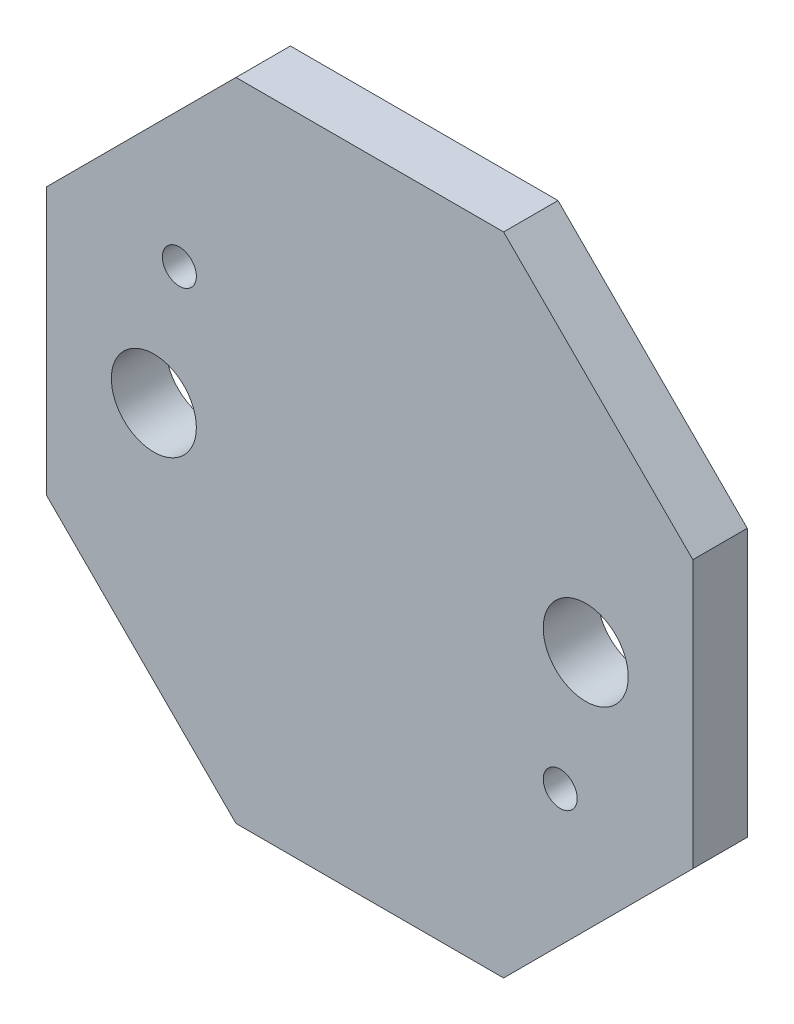
ISO-10303-21;
HEADER;
FILE_DESCRIPTION(('STEP AP214'),'2;1');
FILE_NAME('part.step','',(''),(''),'','','');
FILE_SCHEMA(('AUTOMOTIVE_DESIGN { 1 0 10303 214 1 1 1 1 }'));
ENDSEC;
DATA;
#1=APPLICATION_CONTEXT('core data for automotive mechanical design processes');
#2=APPLICATION_PROTOCOL_DEFINITION('international standard','automotive_design',2000,#1);
#3=PRODUCT_CONTEXT('',#1,'mechanical');
#4=PRODUCT('Part','Part','',(#3));
#5=PRODUCT_RELATED_PRODUCT_CATEGORY('part','',(#4));
#6=PRODUCT_DEFINITION_FORMATION('','',#4);
#7=PRODUCT_DEFINITION_CONTEXT('part definition',#1,'design');
#8=PRODUCT_DEFINITION('design','',#6,#7);
#9=PRODUCT_DEFINITION_SHAPE('','',#8);
#10=(LENGTH_UNIT() NAMED_UNIT(*) SI_UNIT(.MILLI.,.METRE.));
#11=(NAMED_UNIT(*) PLANE_ANGLE_UNIT() SI_UNIT($,.RADIAN.));
#12=(NAMED_UNIT(*) SI_UNIT($,.STERADIAN.) SOLID_ANGLE_UNIT());
#13=UNCERTAINTY_MEASURE_WITH_UNIT(LENGTH_MEASURE(1.E-05),#10,'distance_accuracy_value','');
#14=(GEOMETRIC_REPRESENTATION_CONTEXT(3) GLOBAL_UNCERTAINTY_ASSIGNED_CONTEXT((#13)) GLOBAL_UNIT_ASSIGNED_CONTEXT((#10,
#11,#12)) REPRESENTATION_CONTEXT('',''));
#15=CARTESIAN_POINT('',(0.,0.,0.));
#16=DIRECTION('',(0.,0.,1.));
#17=DIRECTION('',(1.,0.,0.));
#18=AXIS2_PLACEMENT_3D('',#15,#16,#17);
#19=CARTESIAN_POINT('',(0.,0.,1.6));
#20=DIRECTION('',(0.,0.,1.));
#21=DIRECTION('',(1.,0.,0.));
#22=AXIS2_PLACEMENT_3D('',#19,#20,#21);
#23=PLANE('',#22);
#24=CARTESIAN_POINT('',(-6.35,0.,1.6));
#25=DIRECTION('',(0.,0.,1.));
#26=DIRECTION('',(1.,0.,0.));
#27=AXIS2_PLACEMENT_3D('',#24,#25,#26);
#28=CIRCLE('',#27,1.25);
#29=CARTESIAN_POINT('',(-5.1,0.,1.6));
#30=VERTEX_POINT('',#29);
#31=EDGE_CURVE('E188',#30,#30,#28,.T.);
#32=ORIENTED_EDGE('',*,*,#31,.F.);
#33=EDGE_LOOP('',(#32));
#34=FACE_BOUND('',#33,.T.);
#35=CARTESIAN_POINT('',(6.35,0.,1.6));
#36=DIRECTION('',(0.,0.,1.));
#37=DIRECTION('',(1.,0.,0.));
#38=AXIS2_PLACEMENT_3D('',#35,#36,#37);
#39=CIRCLE('',#38,1.25);
#40=CARTESIAN_POINT('',(7.6,0.,1.6));
#41=VERTEX_POINT('',#40);
#42=EDGE_CURVE('E134',#41,#41,#39,.T.);
#43=ORIENTED_EDGE('',*,*,#42,.F.);
#44=EDGE_LOOP('',(#43));
#45=FACE_BOUND('',#44,.T.);
#46=DIRECTION('',(0.,1.,0.));
#47=VECTOR('',#46,1.);
#48=CARTESIAN_POINT('',(9.5,-3.9350288425444,1.6));
#49=LINE('',#48,#47);
#50=CARTESIAN_POINT('',(9.5,-3.9350288425444,1.6));
#51=VERTEX_POINT('',#50);
#52=CARTESIAN_POINT('',(9.5,3.9350288425444,1.6));
#53=VERTEX_POINT('',#52);
#54=EDGE_CURVE('E145',#51,#53,#49,.T.);
#55=ORIENTED_EDGE('',*,*,#54,.T.);
#56=DIRECTION('',(-0.707106781186548,0.707106781186547,0.));
#57=VECTOR('',#56,1.);
#58=CARTESIAN_POINT('',(9.5,3.9350288425444,1.6));
#59=LINE('',#58,#57);
#60=CARTESIAN_POINT('',(3.9350288425444,9.50000000000001,1.6));
#61=VERTEX_POINT('',#60);
#62=EDGE_CURVE('E93',#53,#61,#59,.T.);
#63=ORIENTED_EDGE('',*,*,#62,.T.);
#64=DIRECTION('',(-1.,0.,0.));
#65=VECTOR('',#64,1.);
#66=CARTESIAN_POINT('',(3.9350288425444,9.50000000000001,1.6));
#67=LINE('',#66,#65);
#68=CARTESIAN_POINT('',(-3.93502884254441,9.5,1.6));
#69=VERTEX_POINT('',#68);
#70=EDGE_CURVE('E160',#61,#69,#67,.T.);
#71=ORIENTED_EDGE('',*,*,#70,.T.);
#72=DIRECTION('',(-0.707106781186547,-0.707106781186548,0.));
#73=VECTOR('',#72,1.);
#74=CARTESIAN_POINT('',(-3.93502884254441,9.5,1.6));
#75=LINE('',#74,#73);
#76=CARTESIAN_POINT('',(-9.5,3.93502884254441,1.6));
#77=VERTEX_POINT('',#76);
#78=EDGE_CURVE('E173',#69,#77,#75,.T.);
#79=ORIENTED_EDGE('',*,*,#78,.T.);
#80=DIRECTION('',(0.,-1.,0.));
#81=VECTOR('',#80,1.);
#82=CARTESIAN_POINT('',(-9.5,3.93502884254441,1.6));
#83=LINE('',#82,#81);
#84=CARTESIAN_POINT('',(-9.5,-3.93502884254441,1.6));
#85=VERTEX_POINT('',#84);
#86=EDGE_CURVE('E112',#77,#85,#83,.T.);
#87=ORIENTED_EDGE('',*,*,#86,.T.);
#88=DIRECTION('',(0.707106781186548,-0.707106781186547,0.));
#89=VECTOR('',#88,1.);
#90=CARTESIAN_POINT('',(-9.5,-3.93502884254441,1.6));
#91=LINE('',#90,#89);
#92=CARTESIAN_POINT('',(-3.93502884254441,-9.5,1.6));
#93=VERTEX_POINT('',#92);
#94=EDGE_CURVE('E106',#85,#93,#91,.T.);
#95=ORIENTED_EDGE('',*,*,#94,.T.);
#96=DIRECTION('',(1.,0.,0.));
#97=VECTOR('',#96,1.);
#98=CARTESIAN_POINT('',(-3.93502884254441,-9.5,1.6));
#99=LINE('',#98,#97);
#100=CARTESIAN_POINT('',(3.93502884254441,-9.5,1.6));
#101=VERTEX_POINT('',#100);
#102=EDGE_CURVE('E110',#93,#101,#99,.T.);
#103=ORIENTED_EDGE('',*,*,#102,.T.);
#104=DIRECTION('',(0.707106781186548,0.707106781186548,0.));
#105=VECTOR('',#104,1.);
#106=CARTESIAN_POINT('',(3.93502884254441,-9.5,1.6));
#107=LINE('',#106,#105);
#108=EDGE_CURVE('E50',#101,#51,#107,.T.);
#109=ORIENTED_EDGE('',*,*,#108,.T.);
#110=EDGE_LOOP('',(#55,#63,#71,#79,#87,#95,#103,#109));
#111=FACE_BOUND('',#110,.T.);
#112=CARTESIAN_POINT('',(5.6,-3.85,1.6));
#113=DIRECTION('',(0.,0.,1.));
#114=DIRECTION('',(1.,0.,0.));
#115=AXIS2_PLACEMENT_3D('',#112,#113,#114);
#116=CIRCLE('',#115,0.500000000000001);
#117=CARTESIAN_POINT('',(6.1,-3.85,1.6));
#118=VERTEX_POINT('',#117);
#119=EDGE_CURVE('E182',#118,#118,#116,.T.);
#120=ORIENTED_EDGE('',*,*,#119,.F.);
#121=EDGE_LOOP('',(#120));
#122=FACE_BOUND('',#121,.T.);
#123=CARTESIAN_POINT('',(-5.59999999999997,3.85000000000004,1.6));
#124=DIRECTION('',(0.,0.,1.));
#125=DIRECTION('',(1.,0.,0.));
#126=AXIS2_PLACEMENT_3D('',#123,#124,#125);
#127=CIRCLE('',#126,0.500000000000001);
#128=CARTESIAN_POINT('',(-5.09999999999997,3.85000000000004,1.6));
#129=VERTEX_POINT('',#128);
#130=EDGE_CURVE('E194',#129,#129,#127,.T.);
#131=ORIENTED_EDGE('',*,*,#130,.F.);
#132=EDGE_LOOP('',(#131));
#133=FACE_BOUND('',#132,.T.);
#134=ADVANCED_FACE('F33',(#34,#45,#111,#122,#133),#23,.T.);
#135=CARTESIAN_POINT('',(0.,0.,0.));
#136=DIRECTION('',(0.,0.,1.));
#137=DIRECTION('',(1.,0.,0.));
#138=AXIS2_PLACEMENT_3D('',#135,#136,#137);
#139=PLANE('',#138);
#140=DIRECTION('',(0.,1.,0.));
#141=VECTOR('',#140,1.);
#142=CARTESIAN_POINT('',(9.5,-3.9350288425444,0.));
#143=LINE('',#142,#141);
#144=CARTESIAN_POINT('',(9.5,-3.9350288425444,0.));
#145=VERTEX_POINT('',#144);
#146=CARTESIAN_POINT('',(9.5,3.9350288425444,0.));
#147=VERTEX_POINT('',#146);
#148=EDGE_CURVE('E130',#145,#147,#143,.T.);
#149=ORIENTED_EDGE('',*,*,#148,.F.);
#150=DIRECTION('',(0.707106781186548,0.707106781186548,0.));
#151=VECTOR('',#150,1.);
#152=CARTESIAN_POINT('',(3.93502884254441,-9.5,0.));
#153=LINE('',#152,#151);
#154=CARTESIAN_POINT('',(3.93502884254441,-9.5,0.));
#155=VERTEX_POINT('',#154);
#156=EDGE_CURVE('E85',#155,#145,#153,.T.);
#157=ORIENTED_EDGE('',*,*,#156,.F.);
#158=DIRECTION('',(1.,0.,0.));
#159=VECTOR('',#158,1.);
#160=CARTESIAN_POINT('',(-3.93502884254441,-9.5,0.));
#161=LINE('',#160,#159);
#162=CARTESIAN_POINT('',(-3.93502884254441,-9.5,0.));
#163=VERTEX_POINT('',#162);
#164=EDGE_CURVE('E79',#163,#155,#161,.T.);
#165=ORIENTED_EDGE('',*,*,#164,.F.);
#166=DIRECTION('',(0.707106781186548,-0.707106781186547,0.));
#167=VECTOR('',#166,1.);
#168=CARTESIAN_POINT('',(-9.5,-3.93502884254441,0.));
#169=LINE('',#168,#167);
#170=CARTESIAN_POINT('',(-9.5,-3.93502884254441,0.));
#171=VERTEX_POINT('',#170);
#172=EDGE_CURVE('E120',#171,#163,#169,.T.);
#173=ORIENTED_EDGE('',*,*,#172,.F.);
#174=DIRECTION('',(0.,-1.,0.));
#175=VECTOR('',#174,1.);
#176=CARTESIAN_POINT('',(-9.5,3.93502884254441,0.));
#177=LINE('',#176,#175);
#178=CARTESIAN_POINT('',(-9.5,3.93502884254441,0.));
#179=VERTEX_POINT('',#178);
#180=EDGE_CURVE('E140',#179,#171,#177,.T.);
#181=ORIENTED_EDGE('',*,*,#180,.F.);
#182=DIRECTION('',(-0.707106781186547,-0.707106781186548,0.));
#183=VECTOR('',#182,1.);
#184=CARTESIAN_POINT('',(-3.93502884254441,9.5,0.));
#185=LINE('',#184,#183);
#186=CARTESIAN_POINT('',(-3.93502884254441,9.5,0.));
#187=VERTEX_POINT('',#186);
#188=EDGE_CURVE('E138',#187,#179,#185,.T.);
#189=ORIENTED_EDGE('',*,*,#188,.F.);
#190=DIRECTION('',(-1.,0.,0.));
#191=VECTOR('',#190,1.);
#192=CARTESIAN_POINT('',(3.9350288425444,9.50000000000001,0.));
#193=LINE('',#192,#191);
#194=CARTESIAN_POINT('',(3.9350288425444,9.50000000000001,0.));
#195=VERTEX_POINT('',#194);
#196=EDGE_CURVE('E136',#195,#187,#193,.T.);
#197=ORIENTED_EDGE('',*,*,#196,.F.);
#198=DIRECTION('',(-0.707106781186548,0.707106781186547,0.));
#199=VECTOR('',#198,1.);
#200=CARTESIAN_POINT('',(9.5,3.9350288425444,0.));
#201=LINE('',#200,#199);
#202=EDGE_CURVE('E133',#147,#195,#201,.T.);
#203=ORIENTED_EDGE('',*,*,#202,.F.);
#204=EDGE_LOOP('',(#149,#157,#165,#173,#181,#189,#197,#203));
#205=FACE_BOUND('',#204,.T.);
#206=CARTESIAN_POINT('',(6.35,0.,0.));
#207=DIRECTION('',(0.,0.,1.));
#208=DIRECTION('',(1.,0.,0.));
#209=AXIS2_PLACEMENT_3D('',#206,#207,#208);
#210=CIRCLE('',#209,1.25);
#211=CARTESIAN_POINT('',(7.6,0.,0.));
#212=VERTEX_POINT('',#211);
#213=EDGE_CURVE('E179',#212,#212,#210,.T.);
#214=ORIENTED_EDGE('',*,*,#213,.T.);
#215=EDGE_LOOP('',(#214));
#216=FACE_BOUND('',#215,.T.);
#217=CARTESIAN_POINT('',(5.6,-3.85,0.));
#218=DIRECTION('',(0.,0.,1.));
#219=DIRECTION('',(1.,0.,0.));
#220=AXIS2_PLACEMENT_3D('',#217,#218,#219);
#221=CIRCLE('',#220,0.500000000000001);
#222=CARTESIAN_POINT('',(6.1,-3.85,0.));
#223=VERTEX_POINT('',#222);
#224=EDGE_CURVE('E185',#223,#223,#221,.T.);
#225=ORIENTED_EDGE('',*,*,#224,.T.);
#226=EDGE_LOOP('',(#225));
#227=FACE_BOUND('',#226,.T.);
#228=CARTESIAN_POINT('',(-6.35,0.,0.));
#229=DIRECTION('',(0.,0.,1.));
#230=DIRECTION('',(1.,0.,0.));
#231=AXIS2_PLACEMENT_3D('',#228,#229,#230);
#232=CIRCLE('',#231,1.25);
#233=CARTESIAN_POINT('',(-5.1,0.,0.));
#234=VERTEX_POINT('',#233);
#235=EDGE_CURVE('E191',#234,#234,#232,.T.);
#236=ORIENTED_EDGE('',*,*,#235,.T.);
#237=EDGE_LOOP('',(#236));
#238=FACE_BOUND('',#237,.T.);
#239=CARTESIAN_POINT('',(-5.59999999999997,3.85000000000004,0.));
#240=DIRECTION('',(0.,0.,1.));
#241=DIRECTION('',(1.,0.,0.));
#242=AXIS2_PLACEMENT_3D('',#239,#240,#241);
#243=CIRCLE('',#242,0.500000000000001);
#244=CARTESIAN_POINT('',(-5.09999999999997,3.85000000000004,0.));
#245=VERTEX_POINT('',#244);
#246=EDGE_CURVE('E197',#245,#245,#243,.T.);
#247=ORIENTED_EDGE('',*,*,#246,.T.);
#248=EDGE_LOOP('',(#247));
#249=FACE_BOUND('',#248,.T.);
#250=ADVANCED_FACE('F164',(#205,#216,#227,#238,#249),#139,.F.);
#251=CARTESIAN_POINT('',(9.5,-3.9350288425444,1.6));
#252=DIRECTION('',(-1.,0.,0.));
#253=DIRECTION('',(0.,0.,1.));
#254=AXIS2_PLACEMENT_3D('',#251,#252,#253);
#255=PLANE('',#254);
#256=ORIENTED_EDGE('',*,*,#148,.T.);
#257=DIRECTION('',(0.,0.,-1.));
#258=VECTOR('',#257,1.);
#259=CARTESIAN_POINT('',(9.5,3.9350288425444,1.6));
#260=LINE('',#259,#258);
#261=EDGE_CURVE('E11',#53,#147,#260,.T.);
#262=ORIENTED_EDGE('',*,*,#261,.F.);
#263=ORIENTED_EDGE('',*,*,#54,.F.);
#264=DIRECTION('',(0.,0.,-1.));
#265=VECTOR('',#264,1.);
#266=CARTESIAN_POINT('',(9.5,-3.9350288425444,1.6));
#267=LINE('',#266,#265);
#268=EDGE_CURVE('E126',#51,#145,#267,.T.);
#269=ORIENTED_EDGE('',*,*,#268,.T.);
#270=EDGE_LOOP('',(#256,#262,#263,#269));
#271=FACE_BOUND('',#270,.T.);
#272=ADVANCED_FACE('F35',(#271),#255,.F.);
#273=CARTESIAN_POINT('',(9.5,3.9350288425444,1.6));
#274=DIRECTION('',(-0.707106781186548,-0.707106781186548,0.));
#275=DIRECTION('',(0.707106781186548,-0.707106781186548,0.));
#276=AXIS2_PLACEMENT_3D('',#273,#274,#275);
#277=PLANE('',#276);
#278=ORIENTED_EDGE('',*,*,#202,.T.);
#279=DIRECTION('',(0.,0.,-1.));
#280=VECTOR('',#279,1.);
#281=CARTESIAN_POINT('',(3.9350288425444,9.50000000000001,1.6));
#282=LINE('',#281,#280);
#283=EDGE_CURVE('E42',#61,#195,#282,.T.);
#284=ORIENTED_EDGE('',*,*,#283,.F.);
#285=ORIENTED_EDGE('',*,*,#62,.F.);
#286=ORIENTED_EDGE('',*,*,#261,.T.);
#287=EDGE_LOOP('',(#278,#284,#285,#286));
#288=FACE_BOUND('',#287,.T.);
#289=ADVANCED_FACE('F231',(#288),#277,.F.);
#290=CARTESIAN_POINT('',(3.9350288425444,9.50000000000001,1.6));
#291=DIRECTION('',(0.,-1.,0.));
#292=DIRECTION('',(1.,0.,0.));
#293=AXIS2_PLACEMENT_3D('',#290,#291,#292);
#294=PLANE('',#293);
#295=ORIENTED_EDGE('',*,*,#196,.T.);
#296=DIRECTION('',(0.,0.,-1.));
#297=VECTOR('',#296,1.);
#298=CARTESIAN_POINT('',(-3.93502884254441,9.5,1.6));
#299=LINE('',#298,#297);
#300=EDGE_CURVE('E152',#69,#187,#299,.T.);
#301=ORIENTED_EDGE('',*,*,#300,.F.);
#302=ORIENTED_EDGE('',*,*,#70,.F.);
#303=ORIENTED_EDGE('',*,*,#283,.T.);
#304=EDGE_LOOP('',(#295,#301,#302,#303));
#305=FACE_BOUND('',#304,.T.);
#306=ADVANCED_FACE('F158',(#305),#294,.F.);
#307=CARTESIAN_POINT('',(-3.93502884254441,9.5,1.6));
#308=DIRECTION('',(0.707106781186548,-0.707106781186548,0.));
#309=DIRECTION('',(0.707106781186547,0.707106781186548,0.));
#310=AXIS2_PLACEMENT_3D('',#307,#308,#309);
#311=PLANE('',#310);
#312=ORIENTED_EDGE('',*,*,#188,.T.);
#313=DIRECTION('',(0.,0.,-1.));
#314=VECTOR('',#313,1.);
#315=CARTESIAN_POINT('',(-9.5,3.93502884254441,1.6));
#316=LINE('',#315,#314);
#317=EDGE_CURVE('E149',#77,#179,#316,.T.);
#318=ORIENTED_EDGE('',*,*,#317,.F.);
#319=ORIENTED_EDGE('',*,*,#78,.F.);
#320=ORIENTED_EDGE('',*,*,#300,.T.);
#321=EDGE_LOOP('',(#312,#318,#319,#320));
#322=FACE_BOUND('',#321,.T.);
#323=ADVANCED_FACE('F169',(#322),#311,.F.);
#324=CARTESIAN_POINT('',(-9.5,3.93502884254441,1.6));
#325=DIRECTION('',(1.,0.,0.));
#326=DIRECTION('',(0.,0.,-1.));
#327=AXIS2_PLACEMENT_3D('',#324,#325,#326);
#328=PLANE('',#327);
#329=ORIENTED_EDGE('',*,*,#180,.T.);
#330=DIRECTION('',(0.,0.,-1.));
#331=VECTOR('',#330,1.);
#332=CARTESIAN_POINT('',(-9.5,-3.93502884254441,1.6));
#333=LINE('',#332,#331);
#334=EDGE_CURVE('E121',#85,#171,#333,.T.);
#335=ORIENTED_EDGE('',*,*,#334,.F.);
#336=ORIENTED_EDGE('',*,*,#86,.F.);
#337=ORIENTED_EDGE('',*,*,#317,.T.);
#338=EDGE_LOOP('',(#329,#335,#336,#337));
#339=FACE_BOUND('',#338,.T.);
#340=ADVANCED_FACE('F172',(#339),#328,.F.);
#341=CARTESIAN_POINT('',(-9.5,-3.93502884254441,1.6));
#342=DIRECTION('',(0.707106781186548,0.707106781186548,0.));
#343=DIRECTION('',(-0.707106781186548,0.707106781186548,0.));
#344=AXIS2_PLACEMENT_3D('',#341,#342,#343);
#345=PLANE('',#344);
#346=ORIENTED_EDGE('',*,*,#172,.T.);
#347=DIRECTION('',(0.,0.,-1.));
#348=VECTOR('',#347,1.);
#349=CARTESIAN_POINT('',(-3.93502884254441,-9.5,1.6));
#350=LINE('',#349,#348);
#351=EDGE_CURVE('E117',#93,#163,#350,.T.);
#352=ORIENTED_EDGE('',*,*,#351,.F.);
#353=ORIENTED_EDGE('',*,*,#94,.F.);
#354=ORIENTED_EDGE('',*,*,#334,.T.);
#355=EDGE_LOOP('',(#346,#352,#353,#354));
#356=FACE_BOUND('',#355,.T.);
#357=ADVANCED_FACE('F118',(#356),#345,.F.);
#358=CARTESIAN_POINT('',(-3.93502884254441,-9.5,1.6));
#359=DIRECTION('',(0.,1.,0.));
#360=DIRECTION('',(-1.,0.,0.));
#361=AXIS2_PLACEMENT_3D('',#358,#359,#360);
#362=PLANE('',#361);
#363=ORIENTED_EDGE('',*,*,#164,.T.);
#364=DIRECTION('',(0.,0.,-1.));
#365=VECTOR('',#364,1.);
#366=CARTESIAN_POINT('',(3.93502884254441,-9.5,1.6));
#367=LINE('',#366,#365);
#368=EDGE_CURVE('E122',#101,#155,#367,.T.);
#369=ORIENTED_EDGE('',*,*,#368,.F.);
#370=ORIENTED_EDGE('',*,*,#102,.F.);
#371=ORIENTED_EDGE('',*,*,#351,.T.);
#372=EDGE_LOOP('',(#363,#369,#370,#371));
#373=FACE_BOUND('',#372,.T.);
#374=ADVANCED_FACE('F124',(#373),#362,.F.);
#375=CARTESIAN_POINT('',(3.93502884254441,-9.5,1.6));
#376=DIRECTION('',(-0.707106781186548,0.707106781186548,0.));
#377=DIRECTION('',(-0.707106781186548,-0.707106781186548,0.));
#378=AXIS2_PLACEMENT_3D('',#375,#376,#377);
#379=PLANE('',#378);
#380=ORIENTED_EDGE('',*,*,#156,.T.);
#381=ORIENTED_EDGE('',*,*,#268,.F.);
#382=ORIENTED_EDGE('',*,*,#108,.F.);
#383=ORIENTED_EDGE('',*,*,#368,.T.);
#384=EDGE_LOOP('',(#380,#381,#382,#383));
#385=FACE_BOUND('',#384,.T.);
#386=ADVANCED_FACE('F219',(#385),#379,.F.);
#387=CARTESIAN_POINT('',(6.35,0.,1.6));
#388=DIRECTION('',(0.,0.,-1.));
#389=DIRECTION('',(-1.,0.,0.));
#390=AXIS2_PLACEMENT_3D('',#387,#388,#389);
#391=CYLINDRICAL_SURFACE('',#390,1.25);
#392=ORIENTED_EDGE('',*,*,#42,.T.);
#393=EDGE_LOOP('',(#392));
#394=FACE_BOUND('',#393,.T.);
#395=ORIENTED_EDGE('',*,*,#213,.F.);
#396=EDGE_LOOP('',(#395));
#397=FACE_BOUND('',#396,.T.);
#398=ADVANCED_FACE('F216',(#394,#397),#391,.F.);
#399=CARTESIAN_POINT('',(5.6,-3.85,1.6));
#400=DIRECTION('',(0.,0.,-1.));
#401=DIRECTION('',(-1.,0.,0.));
#402=AXIS2_PLACEMENT_3D('',#399,#400,#401);
#403=CYLINDRICAL_SURFACE('',#402,0.500000000000001);
#404=ORIENTED_EDGE('',*,*,#119,.T.);
#405=EDGE_LOOP('',(#404));
#406=FACE_BOUND('',#405,.T.);
#407=ORIENTED_EDGE('',*,*,#224,.F.);
#408=EDGE_LOOP('',(#407));
#409=FACE_BOUND('',#408,.T.);
#410=ADVANCED_FACE('F295',(#406,#409),#403,.F.);
#411=CARTESIAN_POINT('',(-6.35,0.,1.6));
#412=DIRECTION('',(0.,0.,-1.));
#413=DIRECTION('',(-1.,0.,0.));
#414=AXIS2_PLACEMENT_3D('',#411,#412,#413);
#415=CYLINDRICAL_SURFACE('',#414,1.25);
#416=ORIENTED_EDGE('',*,*,#31,.T.);
#417=EDGE_LOOP('',(#416));
#418=FACE_BOUND('',#417,.T.);
#419=ORIENTED_EDGE('',*,*,#235,.F.);
#420=EDGE_LOOP('',(#419));
#421=FACE_BOUND('',#420,.T.);
#422=ADVANCED_FACE('F303',(#418,#421),#415,.F.);
#423=CARTESIAN_POINT('',(-5.59999999999997,3.85000000000004,1.6));
#424=DIRECTION('',(0.,0.,-1.));
#425=DIRECTION('',(-1.,0.,0.));
#426=AXIS2_PLACEMENT_3D('',#423,#424,#425);
#427=CYLINDRICAL_SURFACE('',#426,0.500000000000001);
#428=ORIENTED_EDGE('',*,*,#130,.T.);
#429=EDGE_LOOP('',(#428));
#430=FACE_BOUND('',#429,.T.);
#431=ORIENTED_EDGE('',*,*,#246,.F.);
#432=EDGE_LOOP('',(#431));
#433=FACE_BOUND('',#432,.T.);
#434=ADVANCED_FACE('F203',(#430,#433),#427,.F.);
#435=CLOSED_SHELL('',(#134,#250,#272,#289,#306,#323,#340,#357,#374,#386,#398,#410,#422,#434));
#436=MANIFOLD_SOLID_BREP('B2',#435);
#437=ADVANCED_BREP_SHAPE_REPRESENTATION('',(#18,#436),#14);
#438=SHAPE_DEFINITION_REPRESENTATION(#9,#437);
ENDSEC;
END-ISO-10303-21;
